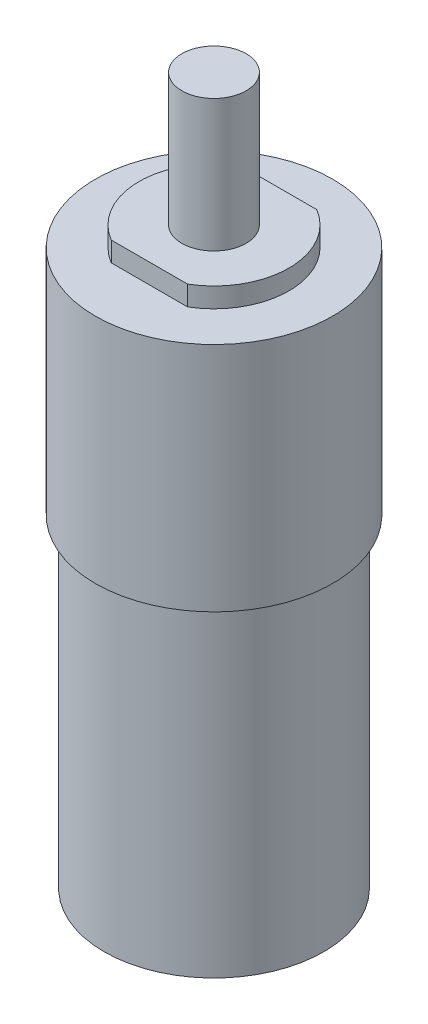
ISO-10303-21;
HEADER;
FILE_DESCRIPTION(('STEP AP214'),'2;1');
FILE_NAME('part.step','',(''),(''),'','','');
FILE_SCHEMA(('AUTOMOTIVE_DESIGN { 1 0 10303 214 1 1 1 1 }'));
ENDSEC;
DATA;
#1=APPLICATION_CONTEXT('core data for automotive mechanical design processes');
#2=APPLICATION_PROTOCOL_DEFINITION('international standard','automotive_design',2000,#1);
#3=PRODUCT_CONTEXT('',#1,'mechanical');
#4=PRODUCT('Part','Part','',(#3));
#5=PRODUCT_RELATED_PRODUCT_CATEGORY('part','',(#4));
#6=PRODUCT_DEFINITION_FORMATION('','',#4);
#7=PRODUCT_DEFINITION_CONTEXT('part definition',#1,'design');
#8=PRODUCT_DEFINITION('design','',#6,#7);
#9=PRODUCT_DEFINITION_SHAPE('','',#8);
#10=(LENGTH_UNIT() NAMED_UNIT(*) SI_UNIT(.MILLI.,.METRE.));
#11=(NAMED_UNIT(*) PLANE_ANGLE_UNIT() SI_UNIT($,.RADIAN.));
#12=(NAMED_UNIT(*) SI_UNIT($,.STERADIAN.) SOLID_ANGLE_UNIT());
#13=UNCERTAINTY_MEASURE_WITH_UNIT(LENGTH_MEASURE(1.E-05),#10,'distance_accuracy_value','');
#14=(GEOMETRIC_REPRESENTATION_CONTEXT(3) GLOBAL_UNCERTAINTY_ASSIGNED_CONTEXT((#13)) GLOBAL_UNIT_ASSIGNED_CONTEXT((#10,
#11,#12)) REPRESENTATION_CONTEXT('',''));
#15=CARTESIAN_POINT('',(0.,0.,0.));
#16=DIRECTION('',(0.,0.,1.));
#17=DIRECTION('',(1.,0.,0.));
#18=AXIS2_PLACEMENT_3D('',#15,#16,#17);
#19=CARTESIAN_POINT('',(0.,53.1368,0.));
#20=DIRECTION('',(0.,-1.,0.));
#21=DIRECTION('',(0.,0.,-1.));
#22=AXIS2_PLACEMENT_3D('',#19,#20,#21);
#23=CYLINDRICAL_SURFACE('',#22,6.9342);
#24=CARTESIAN_POINT('',(0.,53.1368,0.));
#25=DIRECTION('',(0.,1.,0.));
#26=DIRECTION('',(0.,0.,1.));
#27=AXIS2_PLACEMENT_3D('',#24,#25,#26);
#28=CIRCLE('',#27,6.9342);
#29=CARTESIAN_POINT('',(-3.52904642077715,53.1368,-5.969));
#30=VERTEX_POINT('',#29);
#31=CARTESIAN_POINT('',(-3.5290464207772,53.1368,5.969));
#32=VERTEX_POINT('',#31);
#33=EDGE_CURVE('E96',#30,#32,#28,.T.);
#34=ORIENTED_EDGE('',*,*,#33,.F.);
#35=DIRECTION('',(0.,1.,0.));
#36=VECTOR('',#35,1.);
#37=CARTESIAN_POINT('',(-3.5290464207772,44.1842169039195,-5.969));
#38=LINE('',#37,#36);
#39=CARTESIAN_POINT('',(-3.5290464207772,51.308,-5.969));
#40=VERTEX_POINT('',#39);
#41=EDGE_CURVE('E51',#40,#30,#38,.T.);
#42=ORIENTED_EDGE('',*,*,#41,.F.);
#43=CARTESIAN_POINT('',(0.,51.308,0.));
#44=DIRECTION('',(0.,1.,0.));
#45=DIRECTION('',(0.,0.,1.));
#46=AXIS2_PLACEMENT_3D('',#43,#44,#45);
#47=CIRCLE('',#46,6.9342);
#48=CARTESIAN_POINT('',(-3.5290464207772,51.308,5.969));
#49=VERTEX_POINT('',#48);
#50=EDGE_CURVE('E43',#40,#49,#47,.T.);
#51=ORIENTED_EDGE('',*,*,#50,.T.);
#52=DIRECTION('',(0.,1.,0.));
#53=VECTOR('',#52,1.);
#54=CARTESIAN_POINT('',(-3.5290464207772,44.1842169039195,5.969));
#55=LINE('',#54,#53);
#56=EDGE_CURVE('E161',#49,#32,#55,.T.);
#57=ORIENTED_EDGE('',*,*,#56,.T.);
#58=EDGE_LOOP('',(#34,#42,#51,#57));
#59=FACE_BOUND('',#58,.T.);
#60=ADVANCED_FACE('F34',(#59),#23,.T.);
#61=CARTESIAN_POINT('',(0.,29.8958,0.));
#62=DIRECTION('',(0.,-1.,0.));
#63=DIRECTION('',(0.,0.,-1.));
#64=AXIS2_PLACEMENT_3D('',#61,#62,#63);
#65=CYLINDRICAL_SURFACE('',#64,10.16);
#66=CARTESIAN_POINT('',(0.,29.8958,0.));
#67=DIRECTION('',(0.,1.,0.));
#68=DIRECTION('',(0.,0.,1.));
#69=AXIS2_PLACEMENT_3D('',#66,#67,#68);
#70=CIRCLE('',#69,10.16);
#71=CARTESIAN_POINT('',(0.,29.8958,10.16));
#72=VERTEX_POINT('',#71);
#73=EDGE_CURVE('E108',#72,#72,#70,.T.);
#74=ORIENTED_EDGE('',*,*,#73,.F.);
#75=EDGE_LOOP('',(#74));
#76=FACE_BOUND('',#75,.T.);
#77=CARTESIAN_POINT('',(0.,0.,0.));
#78=DIRECTION('',(0.,1.,0.));
#79=DIRECTION('',(0.,0.,1.));
#80=AXIS2_PLACEMENT_3D('',#77,#78,#79);
#81=CIRCLE('',#80,10.16);
#82=CARTESIAN_POINT('',(0.,0.,10.16));
#83=VERTEX_POINT('',#82);
#84=EDGE_CURVE('E106',#83,#83,#81,.T.);
#85=ORIENTED_EDGE('',*,*,#84,.T.);
#86=EDGE_LOOP('',(#85));
#87=FACE_BOUND('',#86,.T.);
#88=ADVANCED_FACE('F36',(#76,#87),#65,.T.);
#89=CARTESIAN_POINT('',(0.,0.,0.));
#90=DIRECTION('',(0.,1.,0.));
#91=DIRECTION('',(0.,0.,1.));
#92=AXIS2_PLACEMENT_3D('',#89,#90,#91);
#93=PLANE('',#92);
#94=ORIENTED_EDGE('',*,*,#84,.F.);
#95=EDGE_LOOP('',(#94));
#96=FACE_BOUND('',#95,.T.);
#97=ADVANCED_FACE('F114',(#96),#93,.F.);
#98=CARTESIAN_POINT('',(0.,51.308,0.));
#99=DIRECTION('',(0.,-1.,0.));
#100=DIRECTION('',(0.,0.,-1.));
#101=AXIS2_PLACEMENT_3D('',#98,#99,#100);
#102=CYLINDRICAL_SURFACE('',#101,10.9728);
#103=CARTESIAN_POINT('',(0.,51.308,0.));
#104=DIRECTION('',(0.,1.,0.));
#105=DIRECTION('',(0.,0.,1.));
#106=AXIS2_PLACEMENT_3D('',#103,#104,#105);
#107=CIRCLE('',#106,10.9728);
#108=CARTESIAN_POINT('',(0.,51.308,10.9728));
#109=VERTEX_POINT('',#108);
#110=EDGE_CURVE('E99',#109,#109,#107,.T.);
#111=ORIENTED_EDGE('',*,*,#110,.F.);
#112=EDGE_LOOP('',(#111));
#113=FACE_BOUND('',#112,.T.);
#114=CARTESIAN_POINT('',(0.,29.8958,0.));
#115=DIRECTION('',(0.,1.,0.));
#116=DIRECTION('',(0.,0.,1.));
#117=AXIS2_PLACEMENT_3D('',#114,#115,#116);
#118=CIRCLE('',#117,10.9728);
#119=CARTESIAN_POINT('',(0.,29.8958,10.9728));
#120=VERTEX_POINT('',#119);
#121=EDGE_CURVE('E95',#120,#120,#118,.T.);
#122=ORIENTED_EDGE('',*,*,#121,.T.);
#123=EDGE_LOOP('',(#122));
#124=FACE_BOUND('',#123,.T.);
#125=ADVANCED_FACE('F116',(#113,#124),#102,.T.);
#126=CARTESIAN_POINT('',(0.,51.308,0.));
#127=DIRECTION('',(0.,1.,0.));
#128=DIRECTION('',(0.,0.,1.));
#129=AXIS2_PLACEMENT_3D('',#126,#127,#128);
#130=PLANE('',#129);
#131=CARTESIAN_POINT('',(3.5290464207772,51.308,5.969));
#132=VERTEX_POINT('',#131);
#133=CARTESIAN_POINT('',(3.5290464207772,51.308,-5.969));
#134=VERTEX_POINT('',#133);
#135=EDGE_CURVE('E11',#132,#134,#47,.T.);
#136=ORIENTED_EDGE('',*,*,#135,.F.);
#137=DIRECTION('',(1.,0.,0.));
#138=VECTOR('',#137,1.);
#139=CARTESIAN_POINT('',(3.5290464207772,51.308,5.969));
#140=LINE('',#139,#138);
#141=EDGE_CURVE('E83',#49,#132,#140,.T.);
#142=ORIENTED_EDGE('',*,*,#141,.F.);
#143=ORIENTED_EDGE('',*,*,#50,.F.);
#144=DIRECTION('',(-1.,0.,0.));
#145=VECTOR('',#144,1.);
#146=CARTESIAN_POINT('',(-3.5290464207772,51.308,-5.969));
#147=LINE('',#146,#145);
#148=EDGE_CURVE('E90',#134,#40,#147,.T.);
#149=ORIENTED_EDGE('',*,*,#148,.F.);
#150=EDGE_LOOP('',(#136,#142,#143,#149));
#151=FACE_BOUND('',#150,.T.);
#152=ORIENTED_EDGE('',*,*,#110,.T.);
#153=EDGE_LOOP('',(#152));
#154=FACE_BOUND('',#153,.T.);
#155=ADVANCED_FACE('F121',(#151,#154),#130,.T.);
#156=CARTESIAN_POINT('',(0.,29.8958,0.));
#157=DIRECTION('',(0.,1.,0.));
#158=DIRECTION('',(0.,0.,1.));
#159=AXIS2_PLACEMENT_3D('',#156,#157,#158);
#160=PLANE('',#159);
#161=ORIENTED_EDGE('',*,*,#73,.T.);
#162=EDGE_LOOP('',(#161));
#163=FACE_BOUND('',#162,.T.);
#164=ORIENTED_EDGE('',*,*,#121,.F.);
#165=EDGE_LOOP('',(#164));
#166=FACE_BOUND('',#165,.T.);
#167=ADVANCED_FACE('F133',(#163,#166),#160,.F.);
#168=ORIENTED_EDGE('',*,*,#135,.T.);
#169=DIRECTION('',(0.,1.,0.));
#170=VECTOR('',#169,1.);
#171=CARTESIAN_POINT('',(3.5290464207772,44.1842169039195,-5.969));
#172=LINE('',#171,#170);
#173=CARTESIAN_POINT('',(3.5290464207772,53.1368,-5.969));
#174=VERTEX_POINT('',#173);
#175=EDGE_CURVE('E77',#134,#174,#172,.T.);
#176=ORIENTED_EDGE('',*,*,#175,.T.);
#177=CARTESIAN_POINT('',(3.52904642077715,53.1368,5.969));
#178=VERTEX_POINT('',#177);
#179=EDGE_CURVE('E88',#178,#174,#28,.T.);
#180=ORIENTED_EDGE('',*,*,#179,.F.);
#181=DIRECTION('',(0.,1.,0.));
#182=VECTOR('',#181,1.);
#183=CARTESIAN_POINT('',(3.5290464207772,44.1842169039195,5.969));
#184=LINE('',#183,#182);
#185=EDGE_CURVE('E59',#132,#178,#184,.T.);
#186=ORIENTED_EDGE('',*,*,#185,.F.);
#187=EDGE_LOOP('',(#168,#176,#180,#186));
#188=FACE_BOUND('',#187,.T.);
#189=ADVANCED_FACE('F87',(#188),#23,.T.);
#190=CARTESIAN_POINT('',(0.,53.1368,0.));
#191=DIRECTION('',(0.,1.,0.));
#192=DIRECTION('',(0.,0.,1.));
#193=AXIS2_PLACEMENT_3D('',#190,#191,#192);
#194=PLANE('',#193);
#195=DIRECTION('',(1.,0.,0.));
#196=VECTOR('',#195,1.);
#197=CARTESIAN_POINT('',(-3.5290464207772,53.1368,-5.969));
#198=LINE('',#197,#196);
#199=EDGE_CURVE('E74',#30,#174,#198,.T.);
#200=ORIENTED_EDGE('',*,*,#199,.F.);
#201=ORIENTED_EDGE('',*,*,#33,.T.);
#202=DIRECTION('',(-1.,0.,0.));
#203=VECTOR('',#202,1.);
#204=CARTESIAN_POINT('',(3.5290464207772,53.1368,5.969));
#205=LINE('',#204,#203);
#206=EDGE_CURVE('E94',#178,#32,#205,.T.);
#207=ORIENTED_EDGE('',*,*,#206,.F.);
#208=ORIENTED_EDGE('',*,*,#179,.T.);
#209=EDGE_LOOP('',(#200,#201,#207,#208));
#210=FACE_BOUND('',#209,.T.);
#211=CARTESIAN_POINT('',(0.,53.1368,0.));
#212=DIRECTION('',(0.,1.,0.));
#213=DIRECTION('',(0.,0.,1.));
#214=AXIS2_PLACEMENT_3D('',#211,#212,#213);
#215=CIRCLE('',#214,2.9718);
#216=CARTESIAN_POINT('',(0.,53.1368,2.9718));
#217=VERTEX_POINT('',#216);
#218=EDGE_CURVE('E38',#217,#217,#215,.F.);
#219=ORIENTED_EDGE('',*,*,#218,.T.);
#220=EDGE_LOOP('',(#219));
#221=FACE_BOUND('',#220,.T.);
#222=ADVANCED_FACE('F92',(#210,#221),#194,.T.);
#223=CARTESIAN_POINT('',(0.,65.3542,0.));
#224=DIRECTION('',(0.,-1.,0.));
#225=DIRECTION('',(0.,0.,-1.));
#226=AXIS2_PLACEMENT_3D('',#223,#224,#225);
#227=CYLINDRICAL_SURFACE('',#226,2.9718);
#228=ORIENTED_EDGE('',*,*,#218,.F.);
#229=EDGE_LOOP('',(#228));
#230=FACE_BOUND('',#229,.T.);
#231=CARTESIAN_POINT('',(0.,65.3542,0.));
#232=DIRECTION('',(0.,1.,0.));
#233=DIRECTION('',(0.,0.,1.));
#234=AXIS2_PLACEMENT_3D('',#231,#232,#233);
#235=CIRCLE('',#234,2.9718);
#236=CARTESIAN_POINT('',(0.,65.3542,2.9718));
#237=VERTEX_POINT('',#236);
#238=EDGE_CURVE('E102',#237,#237,#235,.T.);
#239=ORIENTED_EDGE('',*,*,#238,.F.);
#240=EDGE_LOOP('',(#239));
#241=FACE_BOUND('',#240,.T.);
#242=ADVANCED_FACE('F138',(#230,#241),#227,.T.);
#243=CARTESIAN_POINT('',(0.,65.3542,0.));
#244=DIRECTION('',(0.,1.,0.));
#245=DIRECTION('',(0.,0.,1.));
#246=AXIS2_PLACEMENT_3D('',#243,#244,#245);
#247=PLANE('',#246);
#248=ORIENTED_EDGE('',*,*,#238,.T.);
#249=EDGE_LOOP('',(#248));
#250=FACE_BOUND('',#249,.T.);
#251=ADVANCED_FACE('F166',(#250),#247,.T.);
#252=CARTESIAN_POINT('',(3.5290464207772,44.1842169039195,5.969));
#253=DIRECTION('',(0.,0.,-1.));
#254=DIRECTION('',(-1.,0.,0.));
#255=AXIS2_PLACEMENT_3D('',#252,#253,#254);
#256=PLANE('',#255);
#257=ORIENTED_EDGE('',*,*,#141,.T.);
#258=ORIENTED_EDGE('',*,*,#185,.T.);
#259=ORIENTED_EDGE('',*,*,#206,.T.);
#260=ORIENTED_EDGE('',*,*,#56,.F.);
#261=EDGE_LOOP('',(#257,#258,#259,#260));
#262=FACE_BOUND('',#261,.T.);
#263=ADVANCED_FACE('F164',(#262),#256,.F.);
#264=CARTESIAN_POINT('',(-3.5290464207772,44.1842169039195,-5.969));
#265=DIRECTION('',(0.,0.,1.));
#266=DIRECTION('',(1.,0.,0.));
#267=AXIS2_PLACEMENT_3D('',#264,#265,#266);
#268=PLANE('',#267);
#269=ORIENTED_EDGE('',*,*,#148,.T.);
#270=ORIENTED_EDGE('',*,*,#41,.T.);
#271=ORIENTED_EDGE('',*,*,#199,.T.);
#272=ORIENTED_EDGE('',*,*,#175,.F.);
#273=EDGE_LOOP('',(#269,#270,#271,#272));
#274=FACE_BOUND('',#273,.T.);
#275=ADVANCED_FACE('F76',(#274),#268,.F.);
#276=CLOSED_SHELL('',(#60,#88,#97,#125,#155,#167,#189,#222,#242,#251,#263,#275));
#277=MANIFOLD_SOLID_BREP('B2',#276);
#278=ADVANCED_BREP_SHAPE_REPRESENTATION('',(#18,#277),#14);
#279=SHAPE_DEFINITION_REPRESENTATION(#9,#278);
ENDSEC;
END-ISO-10303-21;
